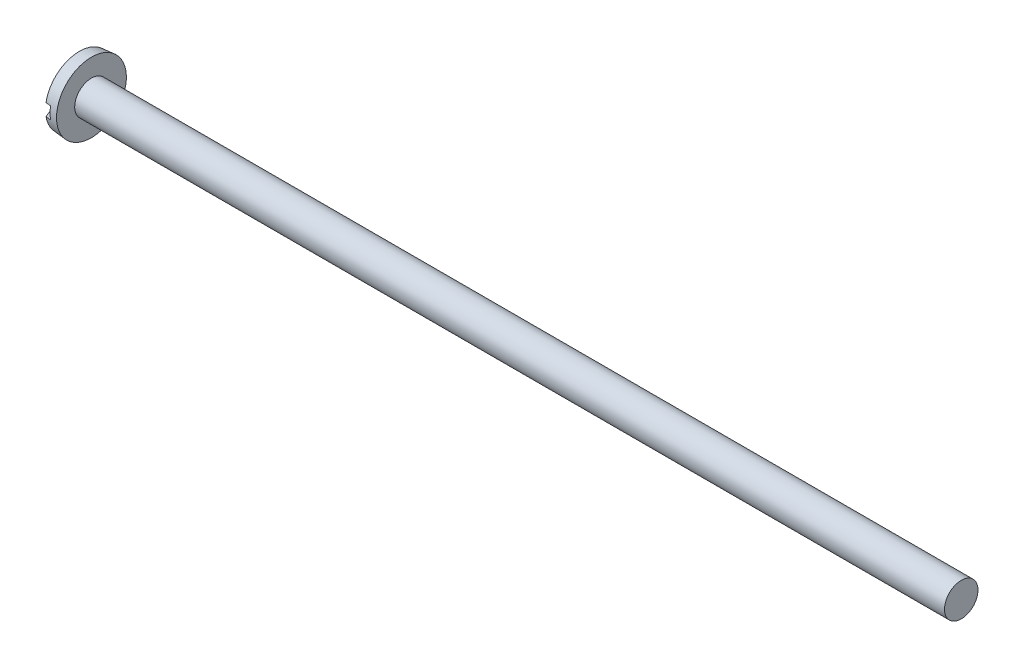
ISO-10303-21;
HEADER;
FILE_DESCRIPTION(('STEP AP214'),'2;1');
FILE_NAME('part.step','',(''),(''),'','','');
FILE_SCHEMA(('AUTOMOTIVE_DESIGN { 1 0 10303 214 1 1 1 1 }'));
ENDSEC;
DATA;
#1=APPLICATION_CONTEXT('core data for automotive mechanical design processes');
#2=APPLICATION_PROTOCOL_DEFINITION('international standard','automotive_design',2000,#1);
#3=PRODUCT_CONTEXT('',#1,'mechanical');
#4=PRODUCT('Part','Part','',(#3));
#5=PRODUCT_RELATED_PRODUCT_CATEGORY('part','',(#4));
#6=PRODUCT_DEFINITION_FORMATION('','',#4);
#7=PRODUCT_DEFINITION_CONTEXT('part definition',#1,'design');
#8=PRODUCT_DEFINITION('design','',#6,#7);
#9=PRODUCT_DEFINITION_SHAPE('','',#8);
#10=(LENGTH_UNIT() NAMED_UNIT(*) SI_UNIT(.MILLI.,.METRE.));
#11=(NAMED_UNIT(*) PLANE_ANGLE_UNIT() SI_UNIT($,.RADIAN.));
#12=(NAMED_UNIT(*) SI_UNIT($,.STERADIAN.) SOLID_ANGLE_UNIT());
#13=UNCERTAINTY_MEASURE_WITH_UNIT(LENGTH_MEASURE(1.E-05),#10,'distance_accuracy_value','');
#14=(GEOMETRIC_REPRESENTATION_CONTEXT(3) GLOBAL_UNCERTAINTY_ASSIGNED_CONTEXT((#13)) GLOBAL_UNIT_ASSIGNED_CONTEXT((#10,
#11,#12)) REPRESENTATION_CONTEXT('',''));
#15=CARTESIAN_POINT('',(0.,0.,0.));
#16=DIRECTION('',(0.,0.,1.));
#17=DIRECTION('',(1.,0.,0.));
#18=AXIS2_PLACEMENT_3D('',#15,#16,#17);
#19=CARTESIAN_POINT('',(2.74603552843517,0.,0.));
#20=DIRECTION('',(-1.,0.,0.));
#21=DIRECTION('',(0.,1.,0.));
#22=AXIS2_PLACEMENT_3D('',#19,#20,#21);
#23=SPHERICAL_SURFACE('',#22,2.74603552843517);
#24=CARTESIAN_POINT('',(0.279399999999999,0.,0.));
#25=DIRECTION('',(-1.,0.,0.));
#26=DIRECTION('',(0.,0.,1.));
#27=AXIS2_PLACEMENT_3D('',#24,#25,#26);
#28=CIRCLE('',#27,1.20682239508951);
#29=CARTESIAN_POINT('',(0.279399999999999,-0.2159,-1.18735314177778));
#30=VERTEX_POINT('',#29);
#31=CARTESIAN_POINT('',(0.279399999999998,-0.2159,1.18735314177778));
#32=VERTEX_POINT('',#31);
#33=EDGE_CURVE('E107',#30,#32,#28,.T.);
#34=ORIENTED_EDGE('',*,*,#33,.T.);
#35=CARTESIAN_POINT('',(2.74603552843517,-0.2159,0.));
#36=DIRECTION('',(0.,1.,0.));
#37=DIRECTION('',(0.,0.,1.));
#38=AXIS2_PLACEMENT_3D('',#35,#36,#37);
#39=CIRCLE('',#38,2.73753507985345);
#40=EDGE_CURVE('E156',#32,#30,#39,.F.);
#41=ORIENTED_EDGE('',*,*,#40,.T.);
#42=EDGE_LOOP('',(#34,#41));
#43=FACE_BOUND('',#42,.T.);
#44=ADVANCED_FACE('F43',(#43),#23,.T.);
#45=CARTESIAN_POINT('',(0.279399999999998,0.2159,1.18735314177778));
#46=VERTEX_POINT('',#45);
#47=CARTESIAN_POINT('',(0.279399999999999,0.2159,-1.18735314177778));
#48=VERTEX_POINT('',#47);
#49=EDGE_CURVE('E110',#46,#48,#28,.T.);
#50=ORIENTED_EDGE('',*,*,#49,.T.);
#51=CARTESIAN_POINT('',(2.74603552843517,0.2159,0.));
#52=DIRECTION('',(0.,-1.,0.));
#53=DIRECTION('',(0.,0.,-1.));
#54=AXIS2_PLACEMENT_3D('',#51,#52,#53);
#55=CIRCLE('',#54,2.73753507985345);
#56=EDGE_CURVE('E151',#48,#46,#55,.F.);
#57=ORIENTED_EDGE('',*,*,#56,.T.);
#58=EDGE_LOOP('',(#50,#57));
#59=FACE_BOUND('',#58,.T.);
#60=ADVANCED_FACE('F154',(#59),#23,.T.);
#61=CARTESIAN_POINT('',(0.711199999999999,0.,0.));
#62=DIRECTION('',(1.,0.,0.));
#63=DIRECTION('',(0.,0.,-1.));
#64=AXIS2_PLACEMENT_3D('',#61,#62,#63);
#65=CONICAL_SURFACE('',#64,1.2446,0.0872664625997181);
#66=CARTESIAN_POINT('',(0.711199999999999,0.,0.));
#67=DIRECTION('',(-1.,0.,0.));
#68=DIRECTION('',(0.,0.,1.));
#69=AXIS2_PLACEMENT_3D('',#66,#67,#68);
#70=CIRCLE('',#69,1.2446);
#71=CARTESIAN_POINT('',(0.711199999999999,0.,1.2446));
#72=VERTEX_POINT('',#71);
#73=EDGE_CURVE('E111',#72,#72,#70,.T.);
#74=ORIENTED_EDGE('',*,*,#73,.T.);
#75=EDGE_LOOP('',(#74));
#76=FACE_BOUND('',#75,.T.);
#77=CARTESIAN_POINT('',(2.5669624784074,-0.2159,-1.3902943960243));
#78=CARTESIAN_POINT('',(2.19662747377263,-0.2159,-1.35750523721982));
#79=CARTESIAN_POINT('',(1.82629474310244,-0.2159,-1.32469036702096));
#80=CARTESIAN_POINT('',(1.08563533119715,-0.2159,-1.25899267269574));
#81=CARTESIAN_POINT('',(0.715308649961707,-0.2159,-1.22610984857325));
#82=CARTESIAN_POINT('',(-0.0253372133816026,-0.2159,-1.1602597106748));
#83=CARTESIAN_POINT('',(-0.395656395489273,-0.2159,-1.12729239689666));
#84=CARTESIAN_POINT('',(-1.1362847861741,-0.2159,-1.0612457038557));
#85=CARTESIAN_POINT('',(-1.50659399475067,-0.2159,-1.02816632458644));
#86=CARTESIAN_POINT('',(-1.87689696281443,-0.2159,-0.995017126129341));
#87=B_SPLINE_CURVE_WITH_KNOTS('',3,(#77,#78,#79,#80,#81,#82,#83,#84,#85,#86),.UNSPECIFIED.,.F.,
.F.,(4,2,2,2,4),(0.,1.11535120342074,2.23070234318675,3.3460535116915,4.46140474439945),.UNSPECIFIED.);
#88=CARTESIAN_POINT('',(0.4572,-0.2159,-1.20316036761685));
#89=VERTEX_POINT('',#88);
#90=EDGE_CURVE('E11',#89,#30,#87,.T.);
#91=ORIENTED_EDGE('',*,*,#90,.F.);
#92=CARTESIAN_POINT('',(0.4572,0.,0.));
#93=DIRECTION('',(-1.,0.,0.));
#94=DIRECTION('',(0.,0.,1.));
#95=AXIS2_PLACEMENT_3D('',#92,#93,#94);
#96=CIRCLE('',#95,1.22237787946441);
#97=CARTESIAN_POINT('',(0.4572,0.2159,-1.20316036761685));
#98=VERTEX_POINT('',#97);
#99=EDGE_CURVE('E88',#98,#89,#96,.T.);
#100=ORIENTED_EDGE('',*,*,#99,.F.);
#101=CARTESIAN_POINT('',(-1.87689696281443,0.2159,-0.995017126129341));
#102=CARTESIAN_POINT('',(-1.25501953785071,0.2159,-1.05068182867533));
#103=CARTESIAN_POINT('',(-0.633125356344622,0.2159,-1.10615873812922));
#104=CARTESIAN_POINT('',(0.107515348289664,0.2159,-1.17206713388135));
#105=CARTESIAN_POINT('',(0.226250334091759,0.2159,-1.18262822295015));
#106=CARTESIAN_POINT('',(1.08563164709804,0.2159,-1.25903432207958));
#107=CARTESIAN_POINT('',(1.82629325835817,0.2159,-1.32470752525744));
#108=CARTESIAN_POINT('',(2.5669624784074,0.2159,-1.3902943960243));
#109=B_SPLINE_CURVE_WITH_KNOTS('',3,(#101,#102,#103,#104,#105,#106,#107,#108),.UNSPECIFIED.,.F.,
.F.,(4,2,2,4),(0.,1.87309114520427,2.23070238788068,4.46140472167824),.UNSPECIFIED.);
#110=EDGE_CURVE('E58',#48,#98,#109,.T.);
#111=ORIENTED_EDGE('',*,*,#110,.F.);
#112=ORIENTED_EDGE('',*,*,#49,.F.);
#113=CARTESIAN_POINT('',(2.5669624784074,0.2159,1.3902943960243));
#114=CARTESIAN_POINT('',(2.19662747377263,0.2159,1.35750523721982));
#115=CARTESIAN_POINT('',(1.82629474310244,0.2159,1.32469036702096));
#116=CARTESIAN_POINT('',(1.08563533119715,0.2159,1.25899267269574));
#117=CARTESIAN_POINT('',(0.715308649961707,0.2159,1.22610984857325));
#118=CARTESIAN_POINT('',(-0.0253372133816028,0.2159,1.1602597106748));
#119=CARTESIAN_POINT('',(-0.395656395489273,0.2159,1.12729239689666));
#120=CARTESIAN_POINT('',(-1.1362847861741,0.2159,1.0612457038557));
#121=CARTESIAN_POINT('',(-1.50659399475067,0.2159,1.02816632458644));
#122=CARTESIAN_POINT('',(-1.87689696281443,0.2159,0.995017126129341));
#123=B_SPLINE_CURVE_WITH_KNOTS('',3,(#113,#114,#115,#116,#117,#118,#119,#120,#121,#122),
.UNSPECIFIED.,.F.,.F.,(4,2,2,2,4),(0.,1.11535120342074,2.23070234318675,3.3460535116915,
4.46140474439945),.UNSPECIFIED.);
#124=CARTESIAN_POINT('',(0.4572,0.2159,1.20316036761685));
#125=VERTEX_POINT('',#124);
#126=EDGE_CURVE('E122',#125,#46,#123,.T.);
#127=ORIENTED_EDGE('',*,*,#126,.F.);
#128=CARTESIAN_POINT('',(0.4572,-0.2159,1.20316036761685));
#129=VERTEX_POINT('',#128);
#130=EDGE_CURVE('E97',#129,#125,#96,.T.);
#131=ORIENTED_EDGE('',*,*,#130,.F.);
#132=CARTESIAN_POINT('',(-1.87689696281443,-0.2159,0.995017126129341));
#133=CARTESIAN_POINT('',(-1.25501953785072,-0.2159,1.05068182867533));
#134=CARTESIAN_POINT('',(-0.633125356344624,-0.2159,1.10615873812922));
#135=CARTESIAN_POINT('',(0.107515348289664,-0.2159,1.17206713388135));
#136=CARTESIAN_POINT('',(0.22625033409176,-0.2159,1.18262822295015));
#137=CARTESIAN_POINT('',(1.08563164709804,-0.2159,1.25903432207958));
#138=CARTESIAN_POINT('',(1.82629325835816,-0.2159,1.32470752525744));
#139=CARTESIAN_POINT('',(2.5669624784074,-0.2159,1.3902943960243));
#140=B_SPLINE_CURVE_WITH_KNOTS('',3,(#132,#133,#134,#135,#136,#137,#138,#139),.UNSPECIFIED.,.F.,
.F.,(4,2,2,4),(0.,1.87309114520427,2.23070238788068,4.46140472167824),.UNSPECIFIED.);
#141=EDGE_CURVE('E95',#32,#129,#140,.T.);
#142=ORIENTED_EDGE('',*,*,#141,.F.);
#143=ORIENTED_EDGE('',*,*,#33,.F.);
#144=EDGE_LOOP('',(#91,#100,#111,#112,#127,#131,#142,#143));
#145=FACE_BOUND('',#144,.T.);
#146=ADVANCED_FACE('F105',(#76,#145),#65,.T.);
#147=CARTESIAN_POINT('',(-25.4,0.,0.));
#148=DIRECTION('',(-1.,0.,0.));
#149=DIRECTION('',(0.,0.,1.));
#150=AXIS2_PLACEMENT_3D('',#147,#148,#149);
#151=CYLINDRICAL_SURFACE('',#150,0.5969);
#152=CARTESIAN_POINT('',(0.711199999999999,0.,0.));
#153=DIRECTION('',(-1.,0.,0.));
#154=DIRECTION('',(0.,0.,1.));
#155=AXIS2_PLACEMENT_3D('',#152,#153,#154);
#156=CIRCLE('',#155,0.5969);
#157=CARTESIAN_POINT('',(0.711199999999999,0.,0.5969));
#158=VERTEX_POINT('',#157);
#159=EDGE_CURVE('E117',#158,#158,#156,.T.);
#160=ORIENTED_EDGE('',*,*,#159,.F.);
#161=EDGE_LOOP('',(#160));
#162=FACE_BOUND('',#161,.T.);
#163=CARTESIAN_POINT('',(31.7119,0.,0.));
#164=DIRECTION('',(1.,0.,0.));
#165=DIRECTION('',(0.,0.,-1.));
#166=AXIS2_PLACEMENT_3D('',#163,#164,#165);
#167=CIRCLE('',#166,0.5969);
#168=CARTESIAN_POINT('',(31.7119,0.,-0.5969));
#169=VERTEX_POINT('',#168);
#170=EDGE_CURVE('E102',#169,#169,#167,.T.);
#171=ORIENTED_EDGE('',*,*,#170,.F.);
#172=EDGE_LOOP('',(#171));
#173=FACE_BOUND('',#172,.T.);
#174=ADVANCED_FACE('F45',(#162,#173),#151,.T.);
#175=CARTESIAN_POINT('',(0.711199999999999,0.5969,0.));
#176=DIRECTION('',(-1.,0.,0.));
#177=DIRECTION('',(0.,0.,1.));
#178=AXIS2_PLACEMENT_3D('',#175,#176,#177);
#179=PLANE('',#178);
#180=ORIENTED_EDGE('',*,*,#73,.F.);
#181=EDGE_LOOP('',(#180));
#182=FACE_BOUND('',#181,.T.);
#183=ORIENTED_EDGE('',*,*,#159,.T.);
#184=EDGE_LOOP('',(#183));
#185=FACE_BOUND('',#184,.T.);
#186=ADVANCED_FACE('F166',(#182,#185),#179,.F.);
#187=CARTESIAN_POINT('',(0.4572,-0.2159,1.2446));
#188=DIRECTION('',(0.,1.,0.));
#189=DIRECTION('',(0.,0.,1.));
#190=AXIS2_PLACEMENT_3D('',#187,#188,#189);
#191=PLANE('',#190);
#192=ORIENTED_EDGE('',*,*,#90,.T.);
#193=ORIENTED_EDGE('',*,*,#40,.F.);
#194=ORIENTED_EDGE('',*,*,#141,.T.);
#195=DIRECTION('',(0.,0.,-1.));
#196=VECTOR('',#195,1.);
#197=CARTESIAN_POINT('',(0.4572,-0.2159,1.2446));
#198=LINE('',#197,#196);
#199=EDGE_CURVE('E65',#129,#89,#198,.T.);
#200=ORIENTED_EDGE('',*,*,#199,.T.);
#201=EDGE_LOOP('',(#192,#193,#194,#200));
#202=FACE_BOUND('',#201,.T.);
#203=ADVANCED_FACE('F98',(#202),#191,.T.);
#204=CARTESIAN_POINT('',(0.4572,0.2159,-1.2446));
#205=DIRECTION('',(0.,-1.,0.));
#206=DIRECTION('',(0.,0.,-1.));
#207=AXIS2_PLACEMENT_3D('',#204,#205,#206);
#208=PLANE('',#207);
#209=ORIENTED_EDGE('',*,*,#110,.T.);
#210=DIRECTION('',(0.,0.,1.));
#211=VECTOR('',#210,1.);
#212=CARTESIAN_POINT('',(0.4572,0.2159,-1.2446));
#213=LINE('',#212,#211);
#214=EDGE_CURVE('E91',#98,#125,#213,.T.);
#215=ORIENTED_EDGE('',*,*,#214,.T.);
#216=ORIENTED_EDGE('',*,*,#126,.T.);
#217=ORIENTED_EDGE('',*,*,#56,.F.);
#218=EDGE_LOOP('',(#209,#215,#216,#217));
#219=FACE_BOUND('',#218,.T.);
#220=ADVANCED_FACE('F136',(#219),#208,.T.);
#221=CARTESIAN_POINT('',(0.4572,-0.2159,1.2446));
#222=DIRECTION('',(-1.,0.,0.));
#223=DIRECTION('',(0.,0.,1.));
#224=AXIS2_PLACEMENT_3D('',#221,#222,#223);
#225=PLANE('',#224);
#226=ORIENTED_EDGE('',*,*,#99,.T.);
#227=ORIENTED_EDGE('',*,*,#199,.F.);
#228=ORIENTED_EDGE('',*,*,#130,.T.);
#229=ORIENTED_EDGE('',*,*,#214,.F.);
#230=EDGE_LOOP('',(#226,#227,#228,#229));
#231=FACE_BOUND('',#230,.T.);
#232=ADVANCED_FACE('F89',(#231),#225,.T.);
#233=CARTESIAN_POINT('',(31.7119,0.,0.));
#234=DIRECTION('',(1.,0.,0.));
#235=DIRECTION('',(0.,0.,-1.));
#236=AXIS2_PLACEMENT_3D('',#233,#234,#235);
#237=PLANE('',#236);
#238=ORIENTED_EDGE('',*,*,#170,.T.);
#239=EDGE_LOOP('',(#238));
#240=FACE_BOUND('',#239,.T.);
#241=ADVANCED_FACE('F175',(#240),#237,.T.);
#242=CLOSED_SHELL('',(#44,#60,#146,#174,#186,#203,#220,#232,#241));
#243=MANIFOLD_SOLID_BREP('B2',#242);
#244=ADVANCED_BREP_SHAPE_REPRESENTATION('',(#18,#243),#14);
#245=SHAPE_DEFINITION_REPRESENTATION(#9,#244);
ENDSEC;
END-ISO-10303-21;
